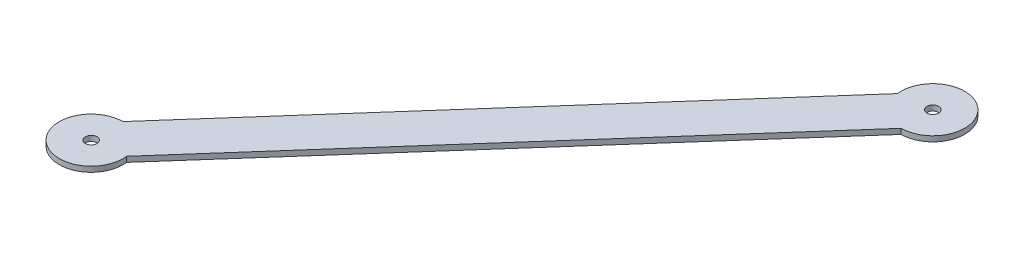
ISO-10303-21;
HEADER;
FILE_DESCRIPTION(('STEP AP214'),'2;1');
FILE_NAME('part.step','',(''),(''),'','','');
FILE_SCHEMA(('AUTOMOTIVE_DESIGN { 1 0 10303 214 1 1 1 1 }'));
ENDSEC;
DATA;
#1=APPLICATION_CONTEXT('core data for automotive mechanical design processes');
#2=APPLICATION_PROTOCOL_DEFINITION('international standard','automotive_design',2000,#1);
#3=PRODUCT_CONTEXT('',#1,'mechanical');
#4=PRODUCT('Part','Part','',(#3));
#5=PRODUCT_RELATED_PRODUCT_CATEGORY('part','',(#4));
#6=PRODUCT_DEFINITION_FORMATION('','',#4);
#7=PRODUCT_DEFINITION_CONTEXT('part definition',#1,'design');
#8=PRODUCT_DEFINITION('design','',#6,#7);
#9=PRODUCT_DEFINITION_SHAPE('','',#8);
#10=(LENGTH_UNIT() NAMED_UNIT(*) SI_UNIT(.MILLI.,.METRE.));
#11=(NAMED_UNIT(*) PLANE_ANGLE_UNIT() SI_UNIT($,.RADIAN.));
#12=(NAMED_UNIT(*) SI_UNIT($,.STERADIAN.) SOLID_ANGLE_UNIT());
#13=UNCERTAINTY_MEASURE_WITH_UNIT(LENGTH_MEASURE(1.E-05),#10,'distance_accuracy_value','');
#14=(GEOMETRIC_REPRESENTATION_CONTEXT(3) GLOBAL_UNCERTAINTY_ASSIGNED_CONTEXT((#13)) GLOBAL_UNIT_ASSIGNED_CONTEXT((#10,
#11,#12)) REPRESENTATION_CONTEXT('',''));
#15=CARTESIAN_POINT('',(0.,0.,0.));
#16=DIRECTION('',(0.,0.,1.));
#17=DIRECTION('',(1.,0.,0.));
#18=AXIS2_PLACEMENT_3D('',#15,#16,#17);
#19=CARTESIAN_POINT('',(-117.65,3.175,133.35));
#20=DIRECTION('',(0.,-1.,0.));
#21=DIRECTION('',(0.,0.,-1.));
#22=AXIS2_PLACEMENT_3D('',#19,#20,#21);
#23=CYLINDRICAL_SURFACE('',#22,3.50000000000001);
#24=CARTESIAN_POINT('',(-117.65,3.175,133.35));
#25=DIRECTION('',(0.,1.,0.));
#26=DIRECTION('',(0.,0.,1.));
#27=AXIS2_PLACEMENT_3D('',#24,#25,#26);
#28=CIRCLE('',#27,3.50000000000001);
#29=CARTESIAN_POINT('',(-117.65,3.175,136.85));
#30=VERTEX_POINT('',#29);
#31=EDGE_CURVE('E145',#30,#30,#28,.T.);
#32=ORIENTED_EDGE('',*,*,#31,.T.);
#33=EDGE_LOOP('',(#32));
#34=FACE_BOUND('',#33,.T.);
#35=CARTESIAN_POINT('',(-117.65,0.,133.35));
#36=DIRECTION('',(0.,1.,0.));
#37=DIRECTION('',(0.,0.,1.));
#38=AXIS2_PLACEMENT_3D('',#35,#36,#37);
#39=CIRCLE('',#38,3.50000000000001);
#40=CARTESIAN_POINT('',(-117.65,0.,136.85));
#41=VERTEX_POINT('',#40);
#42=EDGE_CURVE('E173',#41,#41,#39,.T.);
#43=ORIENTED_EDGE('',*,*,#42,.F.);
#44=EDGE_LOOP('',(#43));
#45=FACE_BOUND('',#44,.T.);
#46=ADVANCED_FACE('F80',(#34,#45),#23,.F.);
#47=CARTESIAN_POINT('',(-117.65,3.175,133.35));
#48=DIRECTION('',(0.,-1.,0.));
#49=DIRECTION('',(0.,0.,-1.));
#50=AXIS2_PLACEMENT_3D('',#47,#48,#49);
#51=CYLINDRICAL_SURFACE('',#50,19.05);
#52=CARTESIAN_POINT('',(-117.65,0.,133.35));
#53=DIRECTION('',(0.,1.,0.));
#54=DIRECTION('',(0.,0.,1.));
#55=AXIS2_PLACEMENT_3D('',#52,#53,#54);
#56=CIRCLE('',#55,19.05);
#57=CARTESIAN_POINT('',(-117.779499182215,0.,114.300440163568));
#58=VERTEX_POINT('',#57);
#59=CARTESIAN_POINT('',(-98.7327840265963,0.,131.104684918413));
#60=VERTEX_POINT('',#59);
#61=EDGE_CURVE('E138',#58,#60,#56,.T.);
#62=ORIENTED_EDGE('',*,*,#61,.T.);
#63=DIRECTION('',(0.,-1.,0.));
#64=VECTOR('',#63,1.);
#65=CARTESIAN_POINT('',(-98.7327840265963,3.175,131.104684918413));
#66=LINE('',#65,#64);
#67=CARTESIAN_POINT('',(-98.7327840265963,3.175,131.104684918413));
#68=VERTEX_POINT('',#67);
#69=EDGE_CURVE('E90',#68,#60,#66,.T.);
#70=ORIENTED_EDGE('',*,*,#69,.F.);
#71=CARTESIAN_POINT('',(-117.65,3.175,133.35));
#72=DIRECTION('',(0.,1.,0.));
#73=DIRECTION('',(0.,0.,1.));
#74=AXIS2_PLACEMENT_3D('',#71,#72,#73);
#75=CIRCLE('',#74,19.05);
#76=CARTESIAN_POINT('',(-117.779499182215,3.175,114.300440163568));
#77=VERTEX_POINT('',#76);
#78=EDGE_CURVE('E125',#77,#68,#75,.T.);
#79=ORIENTED_EDGE('',*,*,#78,.F.);
#80=DIRECTION('',(0.,-1.,0.));
#81=VECTOR('',#80,1.);
#82=CARTESIAN_POINT('',(-117.779499182215,3.175,114.300440163568));
#83=LINE('',#82,#81);
#84=EDGE_CURVE('E13',#77,#58,#83,.T.);
#85=ORIENTED_EDGE('',*,*,#84,.T.);
#86=EDGE_LOOP('',(#62,#70,#79,#85));
#87=FACE_BOUND('',#86,.T.);
#88=ADVANCED_FACE('F136',(#87),#51,.T.);
#89=CARTESIAN_POINT('',(9.52335757780939,3.175,8.40212237742239));
#90=DIRECTION('',(0.749870675418059,0.,0.661584439167114));
#91=DIRECTION('',(0.661584439167114,0.,-0.749870675418059));
#92=AXIS2_PLACEMENT_3D('',#89,#90,#91);
#93=PLANE('',#92);
#94=DIRECTION('',(-0.661584439167114,0.,0.749870675418059));
#95=VECTOR('',#94,1.);
#96=CARTESIAN_POINT('',(9.52335757780939,0.,8.40212237742239));
#97=LINE('',#96,#95);
#98=CARTESIAN_POINT('',(117.779499182215,0.,-114.300440163568));
#99=VERTEX_POINT('',#98);
#100=EDGE_CURVE('E176',#99,#60,#97,.T.);
#101=ORIENTED_EDGE('',*,*,#100,.F.);
#102=DIRECTION('',(0.,-1.,0.));
#103=VECTOR('',#102,1.);
#104=CARTESIAN_POINT('',(117.779499182215,3.175,-114.300440163568));
#105=LINE('',#104,#103);
#106=CARTESIAN_POINT('',(117.779499182215,3.175,-114.300440163568));
#107=VERTEX_POINT('',#106);
#108=EDGE_CURVE('E112',#107,#99,#105,.T.);
#109=ORIENTED_EDGE('',*,*,#108,.F.);
#110=DIRECTION('',(-0.661584439167114,0.,0.749870675418059));
#111=VECTOR('',#110,1.);
#112=CARTESIAN_POINT('',(9.52335757780939,3.175,8.40212237742239));
#113=LINE('',#112,#111);
#114=EDGE_CURVE('E130',#107,#68,#113,.T.);
#115=ORIENTED_EDGE('',*,*,#114,.T.);
#116=ORIENTED_EDGE('',*,*,#69,.T.);
#117=EDGE_LOOP('',(#101,#109,#115,#116));
#118=FACE_BOUND('',#117,.T.);
#119=ADVANCED_FACE('F143',(#118),#93,.T.);
#120=CARTESIAN_POINT('',(-9.52335757780928,3.175,-8.40212237742229));
#121=DIRECTION('',(-0.749870675418059,0.,-0.661584439167114));
#122=DIRECTION('',(-0.661584439167114,0.,0.749870675418059));
#123=AXIS2_PLACEMENT_3D('',#120,#121,#122);
#124=PLANE('',#123);
#125=DIRECTION('',(0.661584439167114,0.,-0.749870675418059));
#126=VECTOR('',#125,1.);
#127=CARTESIAN_POINT('',(-9.52335757780928,0.,-8.40212237742229));
#128=LINE('',#127,#126);
#129=CARTESIAN_POINT('',(98.7327840265965,0.,-131.104684918413));
#130=VERTEX_POINT('',#129);
#131=EDGE_CURVE('E163',#58,#130,#128,.T.);
#132=ORIENTED_EDGE('',*,*,#131,.F.);
#133=ORIENTED_EDGE('',*,*,#84,.F.);
#134=DIRECTION('',(0.661584439167114,0.,-0.749870675418059));
#135=VECTOR('',#134,1.);
#136=CARTESIAN_POINT('',(-9.52335757780928,3.175,-8.40212237742229));
#137=LINE('',#136,#135);
#138=CARTESIAN_POINT('',(98.7327840265965,3.175,-131.104684918413));
#139=VERTEX_POINT('',#138);
#140=EDGE_CURVE('E131',#77,#139,#137,.T.);
#141=ORIENTED_EDGE('',*,*,#140,.T.);
#142=DIRECTION('',(0.,-1.,0.));
#143=VECTOR('',#142,1.);
#144=CARTESIAN_POINT('',(98.7327840265965,3.175,-131.104684918413));
#145=LINE('',#144,#143);
#146=EDGE_CURVE('E99',#139,#130,#145,.T.);
#147=ORIENTED_EDGE('',*,*,#146,.T.);
#148=EDGE_LOOP('',(#132,#133,#141,#147));
#149=FACE_BOUND('',#148,.T.);
#150=ADVANCED_FACE('F182',(#149),#124,.T.);
#151=CARTESIAN_POINT('',(0.,0.,0.));
#152=DIRECTION('',(0.,1.,0.));
#153=DIRECTION('',(0.,0.,1.));
#154=AXIS2_PLACEMENT_3D('',#151,#152,#153);
#155=PLANE('',#154);
#156=ORIENTED_EDGE('',*,*,#131,.T.);
#157=CARTESIAN_POINT('',(117.65,0.,-133.35));
#158=DIRECTION('',(0.,1.,0.));
#159=DIRECTION('',(0.,0.,1.));
#160=AXIS2_PLACEMENT_3D('',#157,#158,#159);
#161=CIRCLE('',#160,19.05);
#162=EDGE_CURVE('E84',#99,#130,#161,.T.);
#163=ORIENTED_EDGE('',*,*,#162,.F.);
#164=ORIENTED_EDGE('',*,*,#100,.T.);
#165=ORIENTED_EDGE('',*,*,#61,.F.);
#166=EDGE_LOOP('',(#156,#163,#164,#165));
#167=FACE_BOUND('',#166,.T.);
#168=ORIENTED_EDGE('',*,*,#42,.T.);
#169=EDGE_LOOP('',(#168));
#170=FACE_BOUND('',#169,.T.);
#171=CARTESIAN_POINT('',(117.65,0.,-133.35));
#172=DIRECTION('',(0.,1.,0.));
#173=DIRECTION('',(0.,0.,1.));
#174=AXIS2_PLACEMENT_3D('',#171,#172,#173);
#175=CIRCLE('',#174,3.50000000000001);
#176=CARTESIAN_POINT('',(117.65,0.,-129.85));
#177=VERTEX_POINT('',#176);
#178=EDGE_CURVE('E164',#177,#177,#175,.T.);
#179=ORIENTED_EDGE('',*,*,#178,.T.);
#180=EDGE_LOOP('',(#179));
#181=FACE_BOUND('',#180,.T.);
#182=ADVANCED_FACE('F180',(#167,#170,#181),#155,.F.);
#183=CARTESIAN_POINT('',(0.,3.175,0.));
#184=DIRECTION('',(0.,1.,0.));
#185=DIRECTION('',(0.,0.,1.));
#186=AXIS2_PLACEMENT_3D('',#183,#184,#185);
#187=PLANE('',#186);
#188=ORIENTED_EDGE('',*,*,#140,.F.);
#189=ORIENTED_EDGE('',*,*,#78,.T.);
#190=ORIENTED_EDGE('',*,*,#114,.F.);
#191=CARTESIAN_POINT('',(117.65,3.175,-133.35));
#192=DIRECTION('',(0.,1.,0.));
#193=DIRECTION('',(0.,0.,1.));
#194=AXIS2_PLACEMENT_3D('',#191,#192,#193);
#195=CIRCLE('',#194,19.05);
#196=EDGE_CURVE('E160',#107,#139,#195,.T.);
#197=ORIENTED_EDGE('',*,*,#196,.T.);
#198=EDGE_LOOP('',(#188,#189,#190,#197));
#199=FACE_BOUND('',#198,.T.);
#200=ORIENTED_EDGE('',*,*,#31,.F.);
#201=EDGE_LOOP('',(#200));
#202=FACE_BOUND('',#201,.T.);
#203=CARTESIAN_POINT('',(117.65,3.175,-133.35));
#204=DIRECTION('',(0.,1.,0.));
#205=DIRECTION('',(0.,0.,1.));
#206=AXIS2_PLACEMENT_3D('',#203,#204,#205);
#207=CIRCLE('',#206,3.50000000000001);
#208=CARTESIAN_POINT('',(117.65,3.175,-129.85));
#209=VERTEX_POINT('',#208);
#210=EDGE_CURVE('E166',#209,#209,#207,.T.);
#211=ORIENTED_EDGE('',*,*,#210,.F.);
#212=EDGE_LOOP('',(#211));
#213=FACE_BOUND('',#212,.T.);
#214=ADVANCED_FACE('F127',(#199,#202,#213),#187,.T.);
#215=CARTESIAN_POINT('',(117.65,3.175,-133.35));
#216=DIRECTION('',(0.,-1.,0.));
#217=DIRECTION('',(0.,0.,-1.));
#218=AXIS2_PLACEMENT_3D('',#215,#216,#217);
#219=CYLINDRICAL_SURFACE('',#218,3.50000000000001);
#220=ORIENTED_EDGE('',*,*,#210,.T.);
#221=EDGE_LOOP('',(#220));
#222=FACE_BOUND('',#221,.T.);
#223=ORIENTED_EDGE('',*,*,#178,.F.);
#224=EDGE_LOOP('',(#223));
#225=FACE_BOUND('',#224,.T.);
#226=ADVANCED_FACE('F201',(#222,#225),#219,.F.);
#227=CARTESIAN_POINT('',(117.65,3.175,-133.35));
#228=DIRECTION('',(0.,-1.,0.));
#229=DIRECTION('',(0.,0.,-1.));
#230=AXIS2_PLACEMENT_3D('',#227,#228,#229);
#231=CYLINDRICAL_SURFACE('',#230,19.05);
#232=ORIENTED_EDGE('',*,*,#146,.F.);
#233=ORIENTED_EDGE('',*,*,#196,.F.);
#234=ORIENTED_EDGE('',*,*,#108,.T.);
#235=ORIENTED_EDGE('',*,*,#162,.T.);
#236=EDGE_LOOP('',(#232,#233,#234,#235));
#237=FACE_BOUND('',#236,.T.);
#238=ADVANCED_FACE('F82',(#237),#231,.T.);
#239=CLOSED_SHELL('',(#46,#88,#119,#150,#182,#214,#226,#238));
#240=MANIFOLD_SOLID_BREP('B2',#239);
#241=ADVANCED_BREP_SHAPE_REPRESENTATION('',(#18,#240),#14);
#242=SHAPE_DEFINITION_REPRESENTATION(#9,#241);
ENDSEC;
END-ISO-10303-21;
